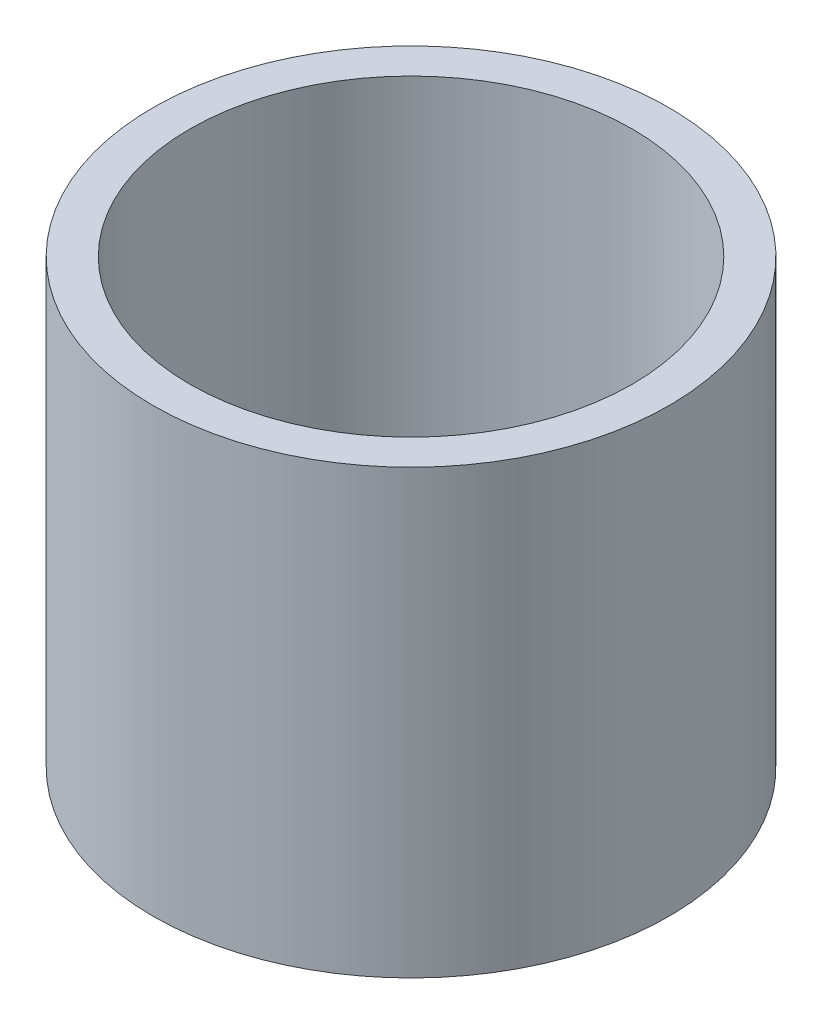
ISO-10303-21;
HEADER;
FILE_DESCRIPTION(('STEP AP214'),'2;1');
FILE_NAME('part.step','',(''),(''),'','','');
FILE_SCHEMA(('AUTOMOTIVE_DESIGN { 1 0 10303 214 1 1 1 1 }'));
ENDSEC;
DATA;
#1=APPLICATION_CONTEXT('core data for automotive mechanical design processes');
#2=APPLICATION_PROTOCOL_DEFINITION('international standard','automotive_design',2000,#1);
#3=PRODUCT_CONTEXT('',#1,'mechanical');
#4=PRODUCT('Part','Part','',(#3));
#5=PRODUCT_RELATED_PRODUCT_CATEGORY('part','',(#4));
#6=PRODUCT_DEFINITION_FORMATION('','',#4);
#7=PRODUCT_DEFINITION_CONTEXT('part definition',#1,'design');
#8=PRODUCT_DEFINITION('design','',#6,#7);
#9=PRODUCT_DEFINITION_SHAPE('','',#8);
#10=(LENGTH_UNIT() NAMED_UNIT(*) SI_UNIT(.MILLI.,.METRE.));
#11=(NAMED_UNIT(*) PLANE_ANGLE_UNIT() SI_UNIT($,.RADIAN.));
#12=(NAMED_UNIT(*) SI_UNIT($,.STERADIAN.) SOLID_ANGLE_UNIT());
#13=UNCERTAINTY_MEASURE_WITH_UNIT(LENGTH_MEASURE(1.E-05),#10,'distance_accuracy_value','');
#14=(GEOMETRIC_REPRESENTATION_CONTEXT(3) GLOBAL_UNCERTAINTY_ASSIGNED_CONTEXT((#13)) GLOBAL_UNIT_ASSIGNED_CONTEXT((#10,
#11,#12)) REPRESENTATION_CONTEXT('',''));
#15=CARTESIAN_POINT('',(0.,0.,0.));
#16=DIRECTION('',(0.,0.,1.));
#17=DIRECTION('',(1.,0.,0.));
#18=AXIS2_PLACEMENT_3D('',#15,#16,#17);
#19=CARTESIAN_POINT('',(0.,76.2,0.));
#20=DIRECTION('',(0.,1.,0.));
#21=DIRECTION('',(0.,0.,1.));
#22=AXIS2_PLACEMENT_3D('',#19,#20,#21);
#23=PLANE('',#22);
#24=CARTESIAN_POINT('',(0.,76.2,0.));
#25=DIRECTION('',(0.,1.,0.));
#26=DIRECTION('',(0.,0.,1.));
#27=AXIS2_PLACEMENT_3D('',#24,#25,#26);
#28=CIRCLE('',#27,44.45);
#29=CARTESIAN_POINT('',(0.,76.2,44.45));
#30=VERTEX_POINT('',#29);
#31=EDGE_CURVE('E10',#30,#30,#28,.T.);
#32=ORIENTED_EDGE('',*,*,#31,.T.);
#33=EDGE_LOOP('',(#32));
#34=FACE_BOUND('',#33,.T.);
#35=CARTESIAN_POINT('',(0.,76.2,0.));
#36=DIRECTION('',(0.,1.,0.));
#37=DIRECTION('',(0.,0.,1.));
#38=AXIS2_PLACEMENT_3D('',#35,#36,#37);
#39=CIRCLE('',#38,38.1);
#40=CARTESIAN_POINT('',(0.,76.2,38.1));
#41=VERTEX_POINT('',#40);
#42=EDGE_CURVE('E50',#41,#41,#39,.T.);
#43=ORIENTED_EDGE('',*,*,#42,.F.);
#44=EDGE_LOOP('',(#43));
#45=FACE_BOUND('',#44,.T.);
#46=ADVANCED_FACE('F37',(#34,#45),#23,.T.);
#47=CARTESIAN_POINT('',(0.,0.,0.));
#48=DIRECTION('',(0.,1.,0.));
#49=DIRECTION('',(0.,0.,1.));
#50=AXIS2_PLACEMENT_3D('',#47,#48,#49);
#51=PLANE('',#50);
#52=CARTESIAN_POINT('',(0.,0.,0.));
#53=DIRECTION('',(0.,1.,0.));
#54=DIRECTION('',(0.,0.,1.));
#55=AXIS2_PLACEMENT_3D('',#52,#53,#54);
#56=CIRCLE('',#55,44.45);
#57=CARTESIAN_POINT('',(0.,0.,44.45));
#58=VERTEX_POINT('',#57);
#59=EDGE_CURVE('E41',#58,#58,#56,.T.);
#60=ORIENTED_EDGE('',*,*,#59,.F.);
#61=EDGE_LOOP('',(#60));
#62=FACE_BOUND('',#61,.T.);
#63=CARTESIAN_POINT('',(0.,0.,0.));
#64=DIRECTION('',(0.,1.,0.));
#65=DIRECTION('',(0.,0.,1.));
#66=AXIS2_PLACEMENT_3D('',#63,#64,#65);
#67=CIRCLE('',#66,38.1);
#68=CARTESIAN_POINT('',(0.,0.,38.1));
#69=VERTEX_POINT('',#68);
#70=EDGE_CURVE('E52',#69,#69,#67,.T.);
#71=ORIENTED_EDGE('',*,*,#70,.T.);
#72=EDGE_LOOP('',(#71));
#73=FACE_BOUND('',#72,.T.);
#74=ADVANCED_FACE('F64',(#62,#73),#51,.F.);
#75=CARTESIAN_POINT('',(0.,76.2,0.));
#76=DIRECTION('',(0.,-1.,0.));
#77=DIRECTION('',(0.,0.,-1.));
#78=AXIS2_PLACEMENT_3D('',#75,#76,#77);
#79=CYLINDRICAL_SURFACE('',#78,44.45);
#80=ORIENTED_EDGE('',*,*,#31,.F.);
#81=EDGE_LOOP('',(#80));
#82=FACE_BOUND('',#81,.T.);
#83=ORIENTED_EDGE('',*,*,#59,.T.);
#84=EDGE_LOOP('',(#83));
#85=FACE_BOUND('',#84,.T.);
#86=ADVANCED_FACE('F39',(#82,#85),#79,.T.);
#87=CARTESIAN_POINT('',(0.,76.2,0.));
#88=DIRECTION('',(0.,-1.,0.));
#89=DIRECTION('',(0.,0.,-1.));
#90=AXIS2_PLACEMENT_3D('',#87,#88,#89);
#91=CYLINDRICAL_SURFACE('',#90,38.1);
#92=ORIENTED_EDGE('',*,*,#42,.T.);
#93=EDGE_LOOP('',(#92));
#94=FACE_BOUND('',#93,.T.);
#95=ORIENTED_EDGE('',*,*,#70,.F.);
#96=EDGE_LOOP('',(#95));
#97=FACE_BOUND('',#96,.T.);
#98=ADVANCED_FACE('F60',(#94,#97),#91,.F.);
#99=CLOSED_SHELL('',(#46,#74,#86,#98));
#100=MANIFOLD_SOLID_BREP('B2',#99);
#101=ADVANCED_BREP_SHAPE_REPRESENTATION('',(#18,#100),#14);
#102=SHAPE_DEFINITION_REPRESENTATION(#9,#101);
ENDSEC;
END-ISO-10303-21;
